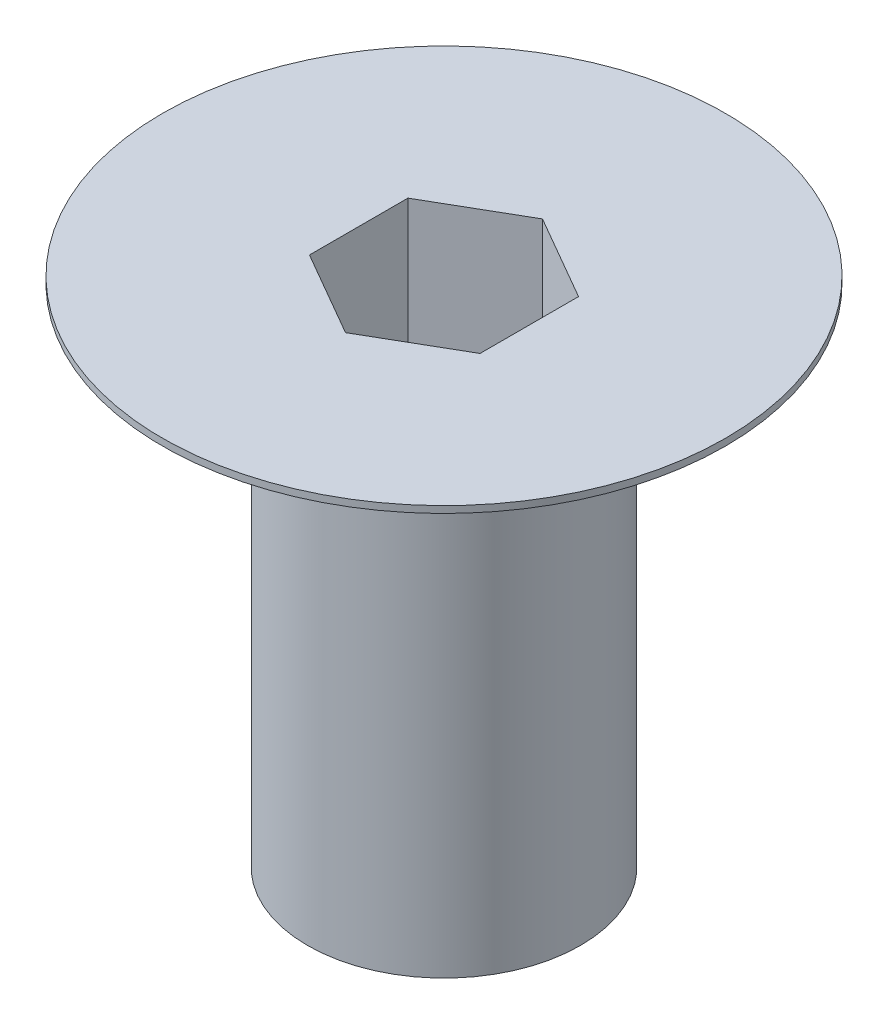
ISO-10303-21;
HEADER;
FILE_DESCRIPTION(('STEP AP214'),'2;1');
FILE_NAME('part.step','',(''),(''),'','','');
FILE_SCHEMA(('AUTOMOTIVE_DESIGN { 1 0 10303 214 1 1 1 1 }'));
ENDSEC;
DATA;
#1=APPLICATION_CONTEXT('core data for automotive mechanical design processes');
#2=APPLICATION_PROTOCOL_DEFINITION('international standard','automotive_design',2000,#1);
#3=PRODUCT_CONTEXT('',#1,'mechanical');
#4=PRODUCT('Part','Part','',(#3));
#5=PRODUCT_RELATED_PRODUCT_CATEGORY('part','',(#4));
#6=PRODUCT_DEFINITION_FORMATION('','',#4);
#7=PRODUCT_DEFINITION_CONTEXT('part definition',#1,'design');
#8=PRODUCT_DEFINITION('design','',#6,#7);
#9=PRODUCT_DEFINITION_SHAPE('','',#8);
#10=(LENGTH_UNIT() NAMED_UNIT(*) SI_UNIT(.MILLI.,.METRE.));
#11=(NAMED_UNIT(*) PLANE_ANGLE_UNIT() SI_UNIT($,.RADIAN.));
#12=(NAMED_UNIT(*) SI_UNIT($,.STERADIAN.) SOLID_ANGLE_UNIT());
#13=UNCERTAINTY_MEASURE_WITH_UNIT(LENGTH_MEASURE(1.E-05),#10,'distance_accuracy_value','');
#14=(GEOMETRIC_REPRESENTATION_CONTEXT(3) GLOBAL_UNCERTAINTY_ASSIGNED_CONTEXT((#13)) GLOBAL_UNIT_ASSIGNED_CONTEXT((#10,
#11,#12)) REPRESENTATION_CONTEXT('',''));
#15=CARTESIAN_POINT('',(0.,0.,0.));
#16=DIRECTION('',(0.,0.,1.));
#17=DIRECTION('',(1.,0.,0.));
#18=AXIS2_PLACEMENT_3D('',#15,#16,#17);
#19=CARTESIAN_POINT('',(0.,0.,0.));
#20=DIRECTION('',(0.,1.,0.));
#21=DIRECTION('',(-1.,0.,0.));
#22=AXIS2_PLACEMENT_3D('',#19,#20,#21);
#23=PLANE('',#22);
#24=CARTESIAN_POINT('',(0.,0.,0.));
#25=DIRECTION('',(0.,1.,0.));
#26=DIRECTION('',(-1.,0.,0.));
#27=AXIS2_PLACEMENT_3D('',#24,#25,#26);
#28=CIRCLE('',#27,4.);
#29=CARTESIAN_POINT('',(-4.,0.,0.));
#30=VERTEX_POINT('',#29);
#31=EDGE_CURVE('E11',#30,#30,#28,.T.);
#32=ORIENTED_EDGE('',*,*,#31,.F.);
#33=EDGE_LOOP('',(#32));
#34=FACE_BOUND('',#33,.T.);
#35=ADVANCED_FACE('F33',(#34),#23,.F.);
#36=CARTESIAN_POINT('',(0.,15.,0.));
#37=DIRECTION('',(0.,1.,0.));
#38=DIRECTION('',(-1.,0.,0.));
#39=AXIS2_PLACEMENT_3D('',#36,#37,#38);
#40=CYLINDRICAL_SURFACE('',#39,4.);
#41=CARTESIAN_POINT('',(0.,12.3462613559441,0.));
#42=DIRECTION('',(0.,1.,0.));
#43=DIRECTION('',(-1.,0.,0.));
#44=AXIS2_PLACEMENT_3D('',#41,#42,#43);
#45=CIRCLE('',#44,4.);
#46=CARTESIAN_POINT('',(-4.00000000000001,12.3462613559441,0.));
#47=VERTEX_POINT('',#46);
#48=EDGE_CURVE('E40',#47,#47,#45,.T.);
#49=ORIENTED_EDGE('',*,*,#48,.F.);
#50=EDGE_LOOP('',(#49));
#51=FACE_BOUND('',#50,.T.);
#52=ORIENTED_EDGE('',*,*,#31,.T.);
#53=EDGE_LOOP('',(#52));
#54=FACE_BOUND('',#53,.T.);
#55=ADVANCED_FACE('F149',(#51,#54),#40,.T.);
#56=CARTESIAN_POINT('',(0.,12.3462613559441,0.));
#57=DIRECTION('',(0.,1.,0.));
#58=DIRECTION('',(-1.,0.,0.));
#59=AXIS2_PLACEMENT_3D('',#56,#57,#58);
#60=CONICAL_SURFACE('',#59,4.,1.04719755119659);
#61=CARTESIAN_POINT('',(0.,14.8,0.));
#62=DIRECTION('',(0.,1.,0.));
#63=DIRECTION('',(-1.,0.,0.));
#64=AXIS2_PLACEMENT_3D('',#61,#62,#63);
#65=CIRCLE('',#64,8.25);
#66=CARTESIAN_POINT('',(-8.25,14.8,0.));
#67=VERTEX_POINT('',#66);
#68=EDGE_CURVE('E142',#67,#67,#65,.T.);
#69=ORIENTED_EDGE('',*,*,#68,.F.);
#70=EDGE_LOOP('',(#69));
#71=FACE_BOUND('',#70,.T.);
#72=ORIENTED_EDGE('',*,*,#48,.T.);
#73=EDGE_LOOP('',(#72));
#74=FACE_BOUND('',#73,.T.);
#75=ADVANCED_FACE('F147',(#71,#74),#60,.T.);
#76=CARTESIAN_POINT('',(0.,15.,0.));
#77=DIRECTION('',(0.,1.,0.));
#78=DIRECTION('',(-1.,0.,0.));
#79=AXIS2_PLACEMENT_3D('',#76,#77,#78);
#80=CYLINDRICAL_SURFACE('',#79,8.25);
#81=CARTESIAN_POINT('',(0.,15.,0.));
#82=DIRECTION('',(0.,1.,0.));
#83=DIRECTION('',(-1.,0.,0.));
#84=AXIS2_PLACEMENT_3D('',#81,#82,#83);
#85=CIRCLE('',#84,8.25);
#86=CARTESIAN_POINT('',(-8.25,15.,0.));
#87=VERTEX_POINT('',#86);
#88=EDGE_CURVE('E134',#87,#87,#85,.T.);
#89=ORIENTED_EDGE('',*,*,#88,.F.);
#90=EDGE_LOOP('',(#89));
#91=FACE_BOUND('',#90,.T.);
#92=ORIENTED_EDGE('',*,*,#68,.T.);
#93=EDGE_LOOP('',(#92));
#94=FACE_BOUND('',#93,.T.);
#95=ADVANCED_FACE('F167',(#91,#94),#80,.T.);
#96=CARTESIAN_POINT('',(8.25,15.,0.));
#97=DIRECTION('',(0.,-1.,0.));
#98=DIRECTION('',(1.,0.,0.));
#99=AXIS2_PLACEMENT_3D('',#96,#97,#98);
#100=PLANE('',#99);
#101=DIRECTION('',(0.,0.,-1.));
#102=VECTOR('',#101,1.);
#103=CARTESIAN_POINT('',(2.5,15.,1.44337567297406));
#104=LINE('',#103,#102);
#105=CARTESIAN_POINT('',(2.5,15.,1.44337567297406));
#106=VERTEX_POINT('',#105);
#107=CARTESIAN_POINT('',(2.5,15.,-1.44337567297406));
#108=VERTEX_POINT('',#107);
#109=EDGE_CURVE('E121',#106,#108,#104,.T.);
#110=ORIENTED_EDGE('',*,*,#109,.F.);
#111=DIRECTION('',(0.866025403784439,0.,-0.5));
#112=VECTOR('',#111,1.);
#113=CARTESIAN_POINT('',(0.,15.,2.88675134594813));
#114=LINE('',#113,#112);
#115=CARTESIAN_POINT('',(0.,15.,2.88675134594813));
#116=VERTEX_POINT('',#115);
#117=EDGE_CURVE('E47',#116,#106,#114,.T.);
#118=ORIENTED_EDGE('',*,*,#117,.F.);
#119=DIRECTION('',(0.866025403784438,0.,0.5));
#120=VECTOR('',#119,1.);
#121=CARTESIAN_POINT('',(-2.5,15.,1.44337567297407));
#122=LINE('',#121,#120);
#123=CARTESIAN_POINT('',(-2.5,15.,1.44337567297407));
#124=VERTEX_POINT('',#123);
#125=EDGE_CURVE('E130',#124,#116,#122,.T.);
#126=ORIENTED_EDGE('',*,*,#125,.F.);
#127=DIRECTION('',(0.,0.,1.));
#128=VECTOR('',#127,1.);
#129=CARTESIAN_POINT('',(-2.5,15.,-1.44337567297406));
#130=LINE('',#129,#128);
#131=CARTESIAN_POINT('',(-2.5,15.,-1.44337567297406));
#132=VERTEX_POINT('',#131);
#133=EDGE_CURVE('E128',#132,#124,#130,.T.);
#134=ORIENTED_EDGE('',*,*,#133,.F.);
#135=DIRECTION('',(-0.866025403784438,0.,0.5));
#136=VECTOR('',#135,1.);
#137=CARTESIAN_POINT('',(0.,15.,-2.88675134594813));
#138=LINE('',#137,#136);
#139=CARTESIAN_POINT('',(0.,15.,-2.88675134594813));
#140=VERTEX_POINT('',#139);
#141=EDGE_CURVE('E95',#140,#132,#138,.T.);
#142=ORIENTED_EDGE('',*,*,#141,.F.);
#143=DIRECTION('',(-0.866025403784439,0.,-0.5));
#144=VECTOR('',#143,1.);
#145=CARTESIAN_POINT('',(2.5,15.,-1.44337567297406));
#146=LINE('',#145,#144);
#147=EDGE_CURVE('E124',#108,#140,#146,.T.);
#148=ORIENTED_EDGE('',*,*,#147,.F.);
#149=EDGE_LOOP('',(#110,#118,#126,#134,#142,#148));
#150=FACE_BOUND('',#149,.T.);
#151=ORIENTED_EDGE('',*,*,#88,.T.);
#152=EDGE_LOOP('',(#151));
#153=FACE_BOUND('',#152,.T.);
#154=ADVANCED_FACE('F175',(#150,#153),#100,.F.);
#155=CARTESIAN_POINT('',(0.,11.,2.88675134594813));
#156=DIRECTION('',(0.5,0.,0.866025403784439));
#157=DIRECTION('',(0.866025403784439,0.,-0.5));
#158=AXIS2_PLACEMENT_3D('',#155,#156,#157);
#159=PLANE('',#158);
#160=ORIENTED_EDGE('',*,*,#117,.T.);
#161=DIRECTION('',(0.,1.,0.));
#162=VECTOR('',#161,1.);
#163=CARTESIAN_POINT('',(2.5,11.,1.44337567297406));
#164=LINE('',#163,#162);
#165=CARTESIAN_POINT('',(2.5,11.,1.44337567297406));
#166=VERTEX_POINT('',#165);
#167=EDGE_CURVE('E77',#166,#106,#164,.T.);
#168=ORIENTED_EDGE('',*,*,#167,.F.);
#169=DIRECTION('',(0.866025403784439,0.,-0.5));
#170=VECTOR('',#169,1.);
#171=CARTESIAN_POINT('',(0.,11.,2.88675134594813));
#172=LINE('',#171,#170);
#173=CARTESIAN_POINT('',(0.,11.,2.88675134594813));
#174=VERTEX_POINT('',#173);
#175=EDGE_CURVE('E132',#174,#166,#172,.T.);
#176=ORIENTED_EDGE('',*,*,#175,.F.);
#177=DIRECTION('',(0.,1.,0.));
#178=VECTOR('',#177,1.);
#179=CARTESIAN_POINT('',(0.,11.,2.88675134594813));
#180=LINE('',#179,#178);
#181=EDGE_CURVE('E55',#174,#116,#180,.T.);
#182=ORIENTED_EDGE('',*,*,#181,.T.);
#183=EDGE_LOOP('',(#160,#168,#176,#182));
#184=FACE_BOUND('',#183,.T.);
#185=ADVANCED_FACE('F183',(#184),#159,.F.);
#186=CARTESIAN_POINT('',(-2.5,11.,1.44337567297407));
#187=DIRECTION('',(-0.5,0.,0.866025403784439));
#188=DIRECTION('',(0.866025403784439,0.,0.5));
#189=AXIS2_PLACEMENT_3D('',#186,#187,#188);
#190=PLANE('',#189);
#191=ORIENTED_EDGE('',*,*,#125,.T.);
#192=ORIENTED_EDGE('',*,*,#181,.F.);
#193=DIRECTION('',(0.866025403784438,0.,0.5));
#194=VECTOR('',#193,1.);
#195=CARTESIAN_POINT('',(-2.5,11.,1.44337567297407));
#196=LINE('',#195,#194);
#197=CARTESIAN_POINT('',(-2.5,11.,1.44337567297407));
#198=VERTEX_POINT('',#197);
#199=EDGE_CURVE('E107',#198,#174,#196,.T.);
#200=ORIENTED_EDGE('',*,*,#199,.F.);
#201=DIRECTION('',(0.,1.,0.));
#202=VECTOR('',#201,1.);
#203=CARTESIAN_POINT('',(-2.5,11.,1.44337567297407));
#204=LINE('',#203,#202);
#205=EDGE_CURVE('E99',#198,#124,#204,.T.);
#206=ORIENTED_EDGE('',*,*,#205,.T.);
#207=EDGE_LOOP('',(#191,#192,#200,#206));
#208=FACE_BOUND('',#207,.T.);
#209=ADVANCED_FACE('F191',(#208),#190,.F.);
#210=CARTESIAN_POINT('',(-2.5,11.,-1.44337567297406));
#211=DIRECTION('',(-1.,0.,0.));
#212=DIRECTION('',(0.,0.,1.));
#213=AXIS2_PLACEMENT_3D('',#210,#211,#212);
#214=PLANE('',#213);
#215=ORIENTED_EDGE('',*,*,#133,.T.);
#216=ORIENTED_EDGE('',*,*,#205,.F.);
#217=DIRECTION('',(0.,0.,1.));
#218=VECTOR('',#217,1.);
#219=CARTESIAN_POINT('',(-2.5,11.,-1.44337567297406));
#220=LINE('',#219,#218);
#221=CARTESIAN_POINT('',(-2.5,11.,-1.44337567297406));
#222=VERTEX_POINT('',#221);
#223=EDGE_CURVE('E103',#222,#198,#220,.T.);
#224=ORIENTED_EDGE('',*,*,#223,.F.);
#225=DIRECTION('',(0.,1.,0.));
#226=VECTOR('',#225,1.);
#227=CARTESIAN_POINT('',(-2.5,11.,-1.44337567297406));
#228=LINE('',#227,#226);
#229=EDGE_CURVE('E88',#222,#132,#228,.T.);
#230=ORIENTED_EDGE('',*,*,#229,.T.);
#231=EDGE_LOOP('',(#215,#216,#224,#230));
#232=FACE_BOUND('',#231,.T.);
#233=ADVANCED_FACE('F104',(#232),#214,.F.);
#234=CARTESIAN_POINT('',(0.,11.,-2.88675134594813));
#235=DIRECTION('',(-0.5,0.,-0.866025403784438));
#236=DIRECTION('',(-0.866025403784439,0.,0.5));
#237=AXIS2_PLACEMENT_3D('',#234,#235,#236);
#238=PLANE('',#237);
#239=ORIENTED_EDGE('',*,*,#141,.T.);
#240=ORIENTED_EDGE('',*,*,#229,.F.);
#241=DIRECTION('',(-0.866025403784438,0.,0.5));
#242=VECTOR('',#241,1.);
#243=CARTESIAN_POINT('',(0.,11.,-2.88675134594813));
#244=LINE('',#243,#242);
#245=CARTESIAN_POINT('',(0.,11.,-2.88675134594813));
#246=VERTEX_POINT('',#245);
#247=EDGE_CURVE('E92',#246,#222,#244,.T.);
#248=ORIENTED_EDGE('',*,*,#247,.F.);
#249=DIRECTION('',(0.,1.,0.));
#250=VECTOR('',#249,1.);
#251=CARTESIAN_POINT('',(0.,11.,-2.88675134594813));
#252=LINE('',#251,#250);
#253=EDGE_CURVE('E100',#246,#140,#252,.T.);
#254=ORIENTED_EDGE('',*,*,#253,.T.);
#255=EDGE_LOOP('',(#239,#240,#248,#254));
#256=FACE_BOUND('',#255,.T.);
#257=ADVANCED_FACE('F90',(#256),#238,.F.);
#258=CARTESIAN_POINT('',(2.5,11.,-1.44337567297406));
#259=DIRECTION('',(0.5,0.,-0.866025403784439));
#260=DIRECTION('',(-0.866025403784439,0.,-0.5));
#261=AXIS2_PLACEMENT_3D('',#258,#259,#260);
#262=PLANE('',#261);
#263=ORIENTED_EDGE('',*,*,#147,.T.);
#264=ORIENTED_EDGE('',*,*,#253,.F.);
#265=DIRECTION('',(-0.866025403784439,0.,-0.5));
#266=VECTOR('',#265,1.);
#267=CARTESIAN_POINT('',(2.5,11.,-1.44337567297406));
#268=LINE('',#267,#266);
#269=CARTESIAN_POINT('',(2.5,11.,-1.44337567297406));
#270=VERTEX_POINT('',#269);
#271=EDGE_CURVE('E113',#270,#246,#268,.T.);
#272=ORIENTED_EDGE('',*,*,#271,.F.);
#273=DIRECTION('',(0.,1.,0.));
#274=VECTOR('',#273,1.);
#275=CARTESIAN_POINT('',(2.5,11.,-1.44337567297406));
#276=LINE('',#275,#274);
#277=EDGE_CURVE('E137',#270,#108,#276,.T.);
#278=ORIENTED_EDGE('',*,*,#277,.T.);
#279=EDGE_LOOP('',(#263,#264,#272,#278));
#280=FACE_BOUND('',#279,.T.);
#281=ADVANCED_FACE('F210',(#280),#262,.F.);
#282=CARTESIAN_POINT('',(2.5,11.,1.44337567297406));
#283=DIRECTION('',(1.,0.,0.));
#284=DIRECTION('',(0.,0.,-1.));
#285=AXIS2_PLACEMENT_3D('',#282,#283,#284);
#286=PLANE('',#285);
#287=ORIENTED_EDGE('',*,*,#109,.T.);
#288=ORIENTED_EDGE('',*,*,#277,.F.);
#289=DIRECTION('',(0.,0.,-1.));
#290=VECTOR('',#289,1.);
#291=CARTESIAN_POINT('',(2.5,11.,1.44337567297406));
#292=LINE('',#291,#290);
#293=EDGE_CURVE('E115',#166,#270,#292,.T.);
#294=ORIENTED_EDGE('',*,*,#293,.F.);
#295=ORIENTED_EDGE('',*,*,#167,.T.);
#296=EDGE_LOOP('',(#287,#288,#294,#295));
#297=FACE_BOUND('',#296,.T.);
#298=ADVANCED_FACE('F217',(#297),#286,.F.);
#299=CARTESIAN_POINT('',(0.,11.,0.));
#300=DIRECTION('',(0.,1.,0.));
#301=DIRECTION('',(0.,0.,1.));
#302=AXIS2_PLACEMENT_3D('',#299,#300,#301);
#303=PLANE('',#302);
#304=ORIENTED_EDGE('',*,*,#175,.T.);
#305=ORIENTED_EDGE('',*,*,#293,.T.);
#306=ORIENTED_EDGE('',*,*,#271,.T.);
#307=ORIENTED_EDGE('',*,*,#247,.T.);
#308=ORIENTED_EDGE('',*,*,#223,.T.);
#309=ORIENTED_EDGE('',*,*,#199,.T.);
#310=EDGE_LOOP('',(#304,#305,#306,#307,#308,#309));
#311=FACE_BOUND('',#310,.T.);
#312=ADVANCED_FACE('F110',(#311),#303,.T.);
#313=CLOSED_SHELL('',(#35,#55,#75,#95,#154,#185,#209,#233,#257,#281,#298,#312));
#314=MANIFOLD_SOLID_BREP('B2',#313);
#315=ADVANCED_BREP_SHAPE_REPRESENTATION('',(#18,#314),#14);
#316=SHAPE_DEFINITION_REPRESENTATION(#9,#315);
ENDSEC;
END-ISO-10303-21;
